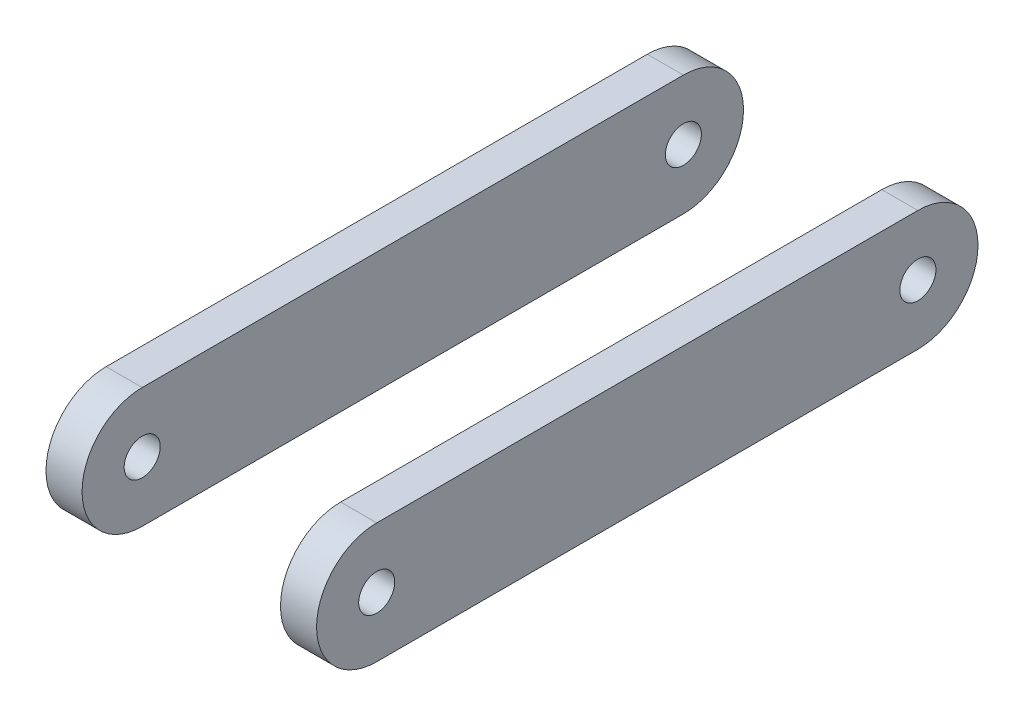
ISO-10303-21;
HEADER;
FILE_DESCRIPTION(('STEP AP214'),'2;1');
FILE_NAME('part.step','',(''),(''),'','','');
FILE_SCHEMA(('AUTOMOTIVE_DESIGN { 1 0 10303 214 1 1 1 1 }'));
ENDSEC;
DATA;
#1=APPLICATION_CONTEXT('core data for automotive mechanical design processes');
#2=APPLICATION_PROTOCOL_DEFINITION('international standard','automotive_design',2000,#1);
#3=PRODUCT_CONTEXT('',#1,'mechanical');
#4=PRODUCT('Part','Part','',(#3));
#5=PRODUCT_RELATED_PRODUCT_CATEGORY('part','',(#4));
#6=PRODUCT_DEFINITION_FORMATION('','',#4);
#7=PRODUCT_DEFINITION_CONTEXT('part definition',#1,'design');
#8=PRODUCT_DEFINITION('design','',#6,#7);
#9=PRODUCT_DEFINITION_SHAPE('','',#8);
#10=(LENGTH_UNIT() NAMED_UNIT(*) SI_UNIT(.MILLI.,.METRE.));
#11=(NAMED_UNIT(*) PLANE_ANGLE_UNIT() SI_UNIT($,.RADIAN.));
#12=(NAMED_UNIT(*) SI_UNIT($,.STERADIAN.) SOLID_ANGLE_UNIT());
#13=UNCERTAINTY_MEASURE_WITH_UNIT(LENGTH_MEASURE(1.E-05),#10,'distance_accuracy_value','');
#14=(GEOMETRIC_REPRESENTATION_CONTEXT(3) GLOBAL_UNCERTAINTY_ASSIGNED_CONTEXT((#13)) GLOBAL_UNIT_ASSIGNED_CONTEXT((#10,
#11,#12)) REPRESENTATION_CONTEXT('',''));
#15=CARTESIAN_POINT('',(0.,0.,0.));
#16=DIRECTION('',(0.,0.,1.));
#17=DIRECTION('',(1.,0.,0.));
#18=AXIS2_PLACEMENT_3D('',#15,#16,#17);
#19=CARTESIAN_POINT('',(-22.5,0.,0.));
#20=DIRECTION('',(1.,0.,0.));
#21=DIRECTION('',(0.,0.,1.));
#22=AXIS2_PLACEMENT_3D('',#19,#20,#21);
#23=CYLINDRICAL_SURFACE('',#22,10.);
#24=CARTESIAN_POINT('',(-16.5,0.,0.));
#25=DIRECTION('',(1.,0.,0.));
#26=DIRECTION('',(0.,0.,-1.));
#27=AXIS2_PLACEMENT_3D('',#24,#25,#26);
#28=CIRCLE('',#27,10.);
#29=CARTESIAN_POINT('',(-16.5,10.,0.));
#30=VERTEX_POINT('',#29);
#31=CARTESIAN_POINT('',(-16.5,-10.,0.));
#32=VERTEX_POINT('',#31);
#33=EDGE_CURVE('E113',#30,#32,#28,.T.);
#34=ORIENTED_EDGE('',*,*,#33,.F.);
#35=DIRECTION('',(1.,0.,0.));
#36=VECTOR('',#35,1.);
#37=CARTESIAN_POINT('',(-22.5,10.,0.));
#38=LINE('',#37,#36);
#39=CARTESIAN_POINT('',(-22.5,10.,0.));
#40=VERTEX_POINT('',#39);
#41=EDGE_CURVE('E112',#40,#30,#38,.T.);
#42=ORIENTED_EDGE('',*,*,#41,.F.);
#43=CARTESIAN_POINT('',(-22.5,0.,0.));
#44=DIRECTION('',(1.,0.,0.));
#45=DIRECTION('',(0.,0.,-1.));
#46=AXIS2_PLACEMENT_3D('',#43,#44,#45);
#47=CIRCLE('',#46,10.);
#48=CARTESIAN_POINT('',(-22.5,-10.,0.));
#49=VERTEX_POINT('',#48);
#50=EDGE_CURVE('E106',#40,#49,#47,.T.);
#51=ORIENTED_EDGE('',*,*,#50,.T.);
#52=DIRECTION('',(1.,0.,0.));
#53=VECTOR('',#52,1.);
#54=CARTESIAN_POINT('',(-22.5,-10.,0.));
#55=LINE('',#54,#53);
#56=EDGE_CURVE('E12',#49,#32,#55,.T.);
#57=ORIENTED_EDGE('',*,*,#56,.T.);
#58=EDGE_LOOP('',(#34,#42,#51,#57));
#59=FACE_BOUND('',#58,.T.);
#60=ADVANCED_FACE('F49',(#59),#23,.T.);
#61=CARTESIAN_POINT('',(-22.5,-10.,0.));
#62=DIRECTION('',(0.,1.,0.));
#63=DIRECTION('',(0.,0.,1.));
#64=AXIS2_PLACEMENT_3D('',#61,#62,#63);
#65=PLANE('',#64);
#66=DIRECTION('',(0.,0.,-1.));
#67=VECTOR('',#66,1.);
#68=CARTESIAN_POINT('',(-16.5,-10.,0.));
#69=LINE('',#68,#67);
#70=CARTESIAN_POINT('',(-16.5,-10.,-90.));
#71=VERTEX_POINT('',#70);
#72=EDGE_CURVE('E115',#32,#71,#69,.T.);
#73=ORIENTED_EDGE('',*,*,#72,.F.);
#74=ORIENTED_EDGE('',*,*,#56,.F.);
#75=DIRECTION('',(0.,0.,-1.));
#76=VECTOR('',#75,1.);
#77=CARTESIAN_POINT('',(-22.5,-10.,0.));
#78=LINE('',#77,#76);
#79=CARTESIAN_POINT('',(-22.5,-10.,-90.));
#80=VERTEX_POINT('',#79);
#81=EDGE_CURVE('E90',#49,#80,#78,.T.);
#82=ORIENTED_EDGE('',*,*,#81,.T.);
#83=DIRECTION('',(1.,0.,0.));
#84=VECTOR('',#83,1.);
#85=CARTESIAN_POINT('',(-22.5,-10.,-90.));
#86=LINE('',#85,#84);
#87=EDGE_CURVE('E57',#80,#71,#86,.T.);
#88=ORIENTED_EDGE('',*,*,#87,.T.);
#89=EDGE_LOOP('',(#73,#74,#82,#88));
#90=FACE_BOUND('',#89,.T.);
#91=ADVANCED_FACE('F104',(#90),#65,.F.);
#92=CARTESIAN_POINT('',(-22.5,0.,-90.));
#93=DIRECTION('',(1.,0.,0.));
#94=DIRECTION('',(0.,0.,1.));
#95=AXIS2_PLACEMENT_3D('',#92,#93,#94);
#96=CYLINDRICAL_SURFACE('',#95,10.);
#97=CARTESIAN_POINT('',(-16.5,0.,-90.));
#98=DIRECTION('',(1.,0.,0.));
#99=DIRECTION('',(0.,0.,-1.));
#100=AXIS2_PLACEMENT_3D('',#97,#98,#99);
#101=CIRCLE('',#100,10.);
#102=CARTESIAN_POINT('',(-16.5,10.,-90.));
#103=VERTEX_POINT('',#102);
#104=EDGE_CURVE('E100',#71,#103,#101,.T.);
#105=ORIENTED_EDGE('',*,*,#104,.F.);
#106=ORIENTED_EDGE('',*,*,#87,.F.);
#107=CARTESIAN_POINT('',(-22.5,0.,-90.));
#108=DIRECTION('',(1.,0.,0.));
#109=DIRECTION('',(0.,0.,-1.));
#110=AXIS2_PLACEMENT_3D('',#107,#108,#109);
#111=CIRCLE('',#110,10.);
#112=CARTESIAN_POINT('',(-22.5,10.,-90.));
#113=VERTEX_POINT('',#112);
#114=EDGE_CURVE('E93',#80,#113,#111,.T.);
#115=ORIENTED_EDGE('',*,*,#114,.T.);
#116=DIRECTION('',(1.,0.,0.));
#117=VECTOR('',#116,1.);
#118=CARTESIAN_POINT('',(-22.5,10.,-90.));
#119=LINE('',#118,#117);
#120=EDGE_CURVE('E103',#113,#103,#119,.T.);
#121=ORIENTED_EDGE('',*,*,#120,.T.);
#122=EDGE_LOOP('',(#105,#106,#115,#121));
#123=FACE_BOUND('',#122,.T.);
#124=ADVANCED_FACE('F99',(#123),#96,.T.);
#125=CARTESIAN_POINT('',(-22.5,10.,0.));
#126=DIRECTION('',(0.,1.,0.));
#127=DIRECTION('',(0.,0.,1.));
#128=AXIS2_PLACEMENT_3D('',#125,#126,#127);
#129=PLANE('',#128);
#130=DIRECTION('',(0.,0.,-1.));
#131=VECTOR('',#130,1.);
#132=CARTESIAN_POINT('',(-16.5,10.,0.));
#133=LINE('',#132,#131);
#134=EDGE_CURVE('E79',#30,#103,#133,.T.);
#135=ORIENTED_EDGE('',*,*,#134,.T.);
#136=ORIENTED_EDGE('',*,*,#120,.F.);
#137=DIRECTION('',(0.,0.,-1.));
#138=VECTOR('',#137,1.);
#139=CARTESIAN_POINT('',(-22.5,10.,0.));
#140=LINE('',#139,#138);
#141=EDGE_CURVE('E65',#40,#113,#140,.T.);
#142=ORIENTED_EDGE('',*,*,#141,.F.);
#143=ORIENTED_EDGE('',*,*,#41,.T.);
#144=EDGE_LOOP('',(#135,#136,#142,#143));
#145=FACE_BOUND('',#144,.T.);
#146=ADVANCED_FACE('F125',(#145),#129,.T.);
#147=CARTESIAN_POINT('',(-22.5,0.,0.));
#148=DIRECTION('',(-1.,0.,0.));
#149=DIRECTION('',(0.,0.,-1.));
#150=AXIS2_PLACEMENT_3D('',#147,#148,#149);
#151=PLANE('',#150);
#152=CARTESIAN_POINT('',(-22.5,0.,0.));
#153=DIRECTION('',(1.,0.,0.));
#154=DIRECTION('',(0.,0.,-1.));
#155=AXIS2_PLACEMENT_3D('',#152,#153,#154);
#156=CIRCLE('',#155,3.00000000000001);
#157=CARTESIAN_POINT('',(-22.5,0.,-3.00000000000001));
#158=VERTEX_POINT('',#157);
#159=EDGE_CURVE('E116',#158,#158,#156,.T.);
#160=ORIENTED_EDGE('',*,*,#159,.T.);
#161=EDGE_LOOP('',(#160));
#162=FACE_BOUND('',#161,.T.);
#163=CARTESIAN_POINT('',(-22.5,0.,-90.));
#164=DIRECTION('',(1.,0.,0.));
#165=DIRECTION('',(0.,0.,-1.));
#166=AXIS2_PLACEMENT_3D('',#163,#164,#165);
#167=CIRCLE('',#166,2.99999999999953);
#168=CARTESIAN_POINT('',(-22.5,0.,-92.9999999999995));
#169=VERTEX_POINT('',#168);
#170=EDGE_CURVE('E196',#169,#169,#167,.T.);
#171=ORIENTED_EDGE('',*,*,#170,.T.);
#172=EDGE_LOOP('',(#171));
#173=FACE_BOUND('',#172,.T.);
#174=ORIENTED_EDGE('',*,*,#50,.F.);
#175=ORIENTED_EDGE('',*,*,#141,.T.);
#176=ORIENTED_EDGE('',*,*,#114,.F.);
#177=ORIENTED_EDGE('',*,*,#81,.F.);
#178=EDGE_LOOP('',(#174,#175,#176,#177));
#179=FACE_BOUND('',#178,.T.);
#180=ADVANCED_FACE('F95',(#162,#173,#179),#151,.T.);
#181=CARTESIAN_POINT('',(-16.5,0.,0.));
#182=DIRECTION('',(-1.,0.,0.));
#183=DIRECTION('',(0.,0.,-1.));
#184=AXIS2_PLACEMENT_3D('',#181,#182,#183);
#185=PLANE('',#184);
#186=CARTESIAN_POINT('',(-16.5,0.,0.));
#187=DIRECTION('',(1.,0.,0.));
#188=DIRECTION('',(0.,0.,-1.));
#189=AXIS2_PLACEMENT_3D('',#186,#187,#188);
#190=CIRCLE('',#189,3.00000000000001);
#191=CARTESIAN_POINT('',(-16.5,0.,-3.00000000000001));
#192=VERTEX_POINT('',#191);
#193=EDGE_CURVE('E195',#192,#192,#190,.T.);
#194=ORIENTED_EDGE('',*,*,#193,.F.);
#195=EDGE_LOOP('',(#194));
#196=FACE_BOUND('',#195,.T.);
#197=CARTESIAN_POINT('',(-16.5,0.,-90.));
#198=DIRECTION('',(1.,0.,0.));
#199=DIRECTION('',(0.,0.,-1.));
#200=AXIS2_PLACEMENT_3D('',#197,#198,#199);
#201=CIRCLE('',#200,2.99999999999953);
#202=CARTESIAN_POINT('',(-16.5,0.,-92.9999999999995));
#203=VERTEX_POINT('',#202);
#204=EDGE_CURVE('E197',#203,#203,#201,.T.);
#205=ORIENTED_EDGE('',*,*,#204,.F.);
#206=EDGE_LOOP('',(#205));
#207=FACE_BOUND('',#206,.T.);
#208=ORIENTED_EDGE('',*,*,#33,.T.);
#209=ORIENTED_EDGE('',*,*,#72,.T.);
#210=ORIENTED_EDGE('',*,*,#104,.T.);
#211=ORIENTED_EDGE('',*,*,#134,.F.);
#212=EDGE_LOOP('',(#208,#209,#210,#211));
#213=FACE_BOUND('',#212,.T.);
#214=ADVANCED_FACE('F121',(#196,#207,#213),#185,.F.);
#215=CARTESIAN_POINT('',(-16.5,0.,-90.));
#216=DIRECTION('',(-1.,0.,0.));
#217=DIRECTION('',(0.,0.,-1.));
#218=AXIS2_PLACEMENT_3D('',#215,#216,#217);
#219=CYLINDRICAL_SURFACE('',#218,2.99999999999953);
#220=ORIENTED_EDGE('',*,*,#170,.F.);
#221=EDGE_LOOP('',(#220));
#222=FACE_BOUND('',#221,.T.);
#223=ORIENTED_EDGE('',*,*,#204,.T.);
#224=EDGE_LOOP('',(#223));
#225=FACE_BOUND('',#224,.T.);
#226=ADVANCED_FACE('F167',(#222,#225),#219,.F.);
#227=CARTESIAN_POINT('',(-16.5,0.,0.));
#228=DIRECTION('',(-1.,0.,0.));
#229=DIRECTION('',(0.,0.,-1.));
#230=AXIS2_PLACEMENT_3D('',#227,#228,#229);
#231=CYLINDRICAL_SURFACE('',#230,3.00000000000001);
#232=ORIENTED_EDGE('',*,*,#159,.F.);
#233=EDGE_LOOP('',(#232));
#234=FACE_BOUND('',#233,.T.);
#235=ORIENTED_EDGE('',*,*,#193,.T.);
#236=EDGE_LOOP('',(#235));
#237=FACE_BOUND('',#236,.T.);
#238=ADVANCED_FACE('F176',(#234,#237),#231,.F.);
#239=CLOSED_SHELL('',(#60,#91,#124,#146,#180,#214,#226,#238));
#240=MANIFOLD_SOLID_BREP('B2',#239);
#241=CARTESIAN_POINT('',(22.5,0.,0.));
#242=DIRECTION('',(-1.,0.,0.));
#243=DIRECTION('',(0.,0.,1.));
#244=AXIS2_PLACEMENT_3D('',#241,#242,#243);
#245=CYLINDRICAL_SURFACE('',#244,10.);
#246=CARTESIAN_POINT('',(16.5,0.,0.));
#247=DIRECTION('',(1.,0.,0.));
#248=DIRECTION('',(0.,0.,-1.));
#249=AXIS2_PLACEMENT_3D('',#246,#247,#248);
#250=CIRCLE('',#249,10.);
#251=CARTESIAN_POINT('',(16.5,10.,0.));
#252=VERTEX_POINT('',#251);
#253=CARTESIAN_POINT('',(16.5,-10.,0.));
#254=VERTEX_POINT('',#253);
#255=EDGE_CURVE('E278',#252,#254,#250,.T.);
#256=ORIENTED_EDGE('',*,*,#255,.T.);
#257=DIRECTION('',(-1.,0.,0.));
#258=VECTOR('',#257,1.);
#259=CARTESIAN_POINT('',(22.5,-10.,0.));
#260=LINE('',#259,#258);
#261=CARTESIAN_POINT('',(22.5,-10.,0.));
#262=VERTEX_POINT('',#261);
#263=EDGE_CURVE('E47',#262,#254,#260,.T.);
#264=ORIENTED_EDGE('',*,*,#263,.F.);
#265=CARTESIAN_POINT('',(22.5,0.,0.));
#266=DIRECTION('',(1.,0.,0.));
#267=DIRECTION('',(0.,0.,-1.));
#268=AXIS2_PLACEMENT_3D('',#265,#266,#267);
#269=CIRCLE('',#268,10.);
#270=CARTESIAN_POINT('',(22.5,10.,0.));
#271=VERTEX_POINT('',#270);
#272=EDGE_CURVE('E264',#271,#262,#269,.T.);
#273=ORIENTED_EDGE('',*,*,#272,.F.);
#274=DIRECTION('',(-1.,0.,0.));
#275=VECTOR('',#274,1.);
#276=CARTESIAN_POINT('',(22.5,10.,0.));
#277=LINE('',#276,#275);
#278=EDGE_CURVE('E231',#271,#252,#277,.T.);
#279=ORIENTED_EDGE('',*,*,#278,.T.);
#280=EDGE_LOOP('',(#256,#264,#273,#279));
#281=FACE_BOUND('',#280,.T.);
#282=ADVANCED_FACE('F215',(#281),#245,.T.);
#283=CARTESIAN_POINT('',(22.5,-10.,0.));
#284=DIRECTION('',(0.,1.,0.));
#285=DIRECTION('',(0.,0.,1.));
#286=AXIS2_PLACEMENT_3D('',#283,#284,#285);
#287=PLANE('',#286);
#288=DIRECTION('',(0.,0.,-1.));
#289=VECTOR('',#288,1.);
#290=CARTESIAN_POINT('',(16.5,-10.,0.));
#291=LINE('',#290,#289);
#292=CARTESIAN_POINT('',(16.5,-10.,-90.));
#293=VERTEX_POINT('',#292);
#294=EDGE_CURVE('E269',#254,#293,#291,.T.);
#295=ORIENTED_EDGE('',*,*,#294,.T.);
#296=DIRECTION('',(-1.,0.,0.));
#297=VECTOR('',#296,1.);
#298=CARTESIAN_POINT('',(22.5,-10.,-90.));
#299=LINE('',#298,#297);
#300=CARTESIAN_POINT('',(22.5,-10.,-90.));
#301=VERTEX_POINT('',#300);
#302=EDGE_CURVE('E223',#301,#293,#299,.T.);
#303=ORIENTED_EDGE('',*,*,#302,.F.);
#304=DIRECTION('',(0.,0.,-1.));
#305=VECTOR('',#304,1.);
#306=CARTESIAN_POINT('',(22.5,-10.,0.));
#307=LINE('',#306,#305);
#308=EDGE_CURVE('E257',#262,#301,#307,.T.);
#309=ORIENTED_EDGE('',*,*,#308,.F.);
#310=ORIENTED_EDGE('',*,*,#263,.T.);
#311=EDGE_LOOP('',(#295,#303,#309,#310));
#312=FACE_BOUND('',#311,.T.);
#313=ADVANCED_FACE('F268',(#312),#287,.F.);
#314=CARTESIAN_POINT('',(22.5,0.,-90.));
#315=DIRECTION('',(-1.,0.,0.));
#316=DIRECTION('',(0.,0.,1.));
#317=AXIS2_PLACEMENT_3D('',#314,#315,#316);
#318=CYLINDRICAL_SURFACE('',#317,10.);
#319=CARTESIAN_POINT('',(16.5,0.,-90.));
#320=DIRECTION('',(1.,0.,0.));
#321=DIRECTION('',(0.,0.,-1.));
#322=AXIS2_PLACEMENT_3D('',#319,#320,#321);
#323=CIRCLE('',#322,10.);
#324=CARTESIAN_POINT('',(16.5,10.,-90.));
#325=VERTEX_POINT('',#324);
#326=EDGE_CURVE('E282',#293,#325,#323,.T.);
#327=ORIENTED_EDGE('',*,*,#326,.T.);
#328=DIRECTION('',(-1.,0.,0.));
#329=VECTOR('',#328,1.);
#330=CARTESIAN_POINT('',(22.5,10.,-90.));
#331=LINE('',#330,#329);
#332=CARTESIAN_POINT('',(22.5,10.,-90.));
#333=VERTEX_POINT('',#332);
#334=EDGE_CURVE('E246',#333,#325,#331,.T.);
#335=ORIENTED_EDGE('',*,*,#334,.F.);
#336=CARTESIAN_POINT('',(22.5,0.,-90.));
#337=DIRECTION('',(1.,0.,0.));
#338=DIRECTION('',(0.,0.,-1.));
#339=AXIS2_PLACEMENT_3D('',#336,#337,#338);
#340=CIRCLE('',#339,10.);
#341=EDGE_CURVE('E263',#301,#333,#340,.T.);
#342=ORIENTED_EDGE('',*,*,#341,.F.);
#343=ORIENTED_EDGE('',*,*,#302,.T.);
#344=EDGE_LOOP('',(#327,#335,#342,#343));
#345=FACE_BOUND('',#344,.T.);
#346=ADVANCED_FACE('F272',(#345),#318,.T.);
#347=CARTESIAN_POINT('',(22.5,10.,0.));
#348=DIRECTION('',(0.,1.,0.));
#349=DIRECTION('',(0.,0.,1.));
#350=AXIS2_PLACEMENT_3D('',#347,#348,#349);
#351=PLANE('',#350);
#352=DIRECTION('',(0.,0.,-1.));
#353=VECTOR('',#352,1.);
#354=CARTESIAN_POINT('',(16.5,10.,0.));
#355=LINE('',#354,#353);
#356=EDGE_CURVE('E284',#252,#325,#355,.T.);
#357=ORIENTED_EDGE('',*,*,#356,.F.);
#358=ORIENTED_EDGE('',*,*,#278,.F.);
#359=DIRECTION('',(0.,0.,-1.));
#360=VECTOR('',#359,1.);
#361=CARTESIAN_POINT('',(22.5,10.,0.));
#362=LINE('',#361,#360);
#363=EDGE_CURVE('E273',#271,#333,#362,.T.);
#364=ORIENTED_EDGE('',*,*,#363,.T.);
#365=ORIENTED_EDGE('',*,*,#334,.T.);
#366=EDGE_LOOP('',(#357,#358,#364,#365));
#367=FACE_BOUND('',#366,.T.);
#368=ADVANCED_FACE('F319',(#367),#351,.T.);
#369=CARTESIAN_POINT('',(22.5,0.,0.));
#370=DIRECTION('',(1.,0.,0.));
#371=DIRECTION('',(0.,0.,-1.));
#372=AXIS2_PLACEMENT_3D('',#369,#370,#371);
#373=PLANE('',#372);
#374=CARTESIAN_POINT('',(22.5,0.,0.));
#375=DIRECTION('',(1.,0.,0.));
#376=DIRECTION('',(0.,0.,-1.));
#377=AXIS2_PLACEMENT_3D('',#374,#375,#376);
#378=CIRCLE('',#377,3.00000000000001);
#379=CARTESIAN_POINT('',(22.5,0.,-3.00000000000001));
#380=VERTEX_POINT('',#379);
#381=EDGE_CURVE('E280',#380,#380,#378,.T.);
#382=ORIENTED_EDGE('',*,*,#381,.F.);
#383=EDGE_LOOP('',(#382));
#384=FACE_BOUND('',#383,.T.);
#385=CARTESIAN_POINT('',(22.5,0.,-90.));
#386=DIRECTION('',(1.,0.,0.));
#387=DIRECTION('',(0.,0.,-1.));
#388=AXIS2_PLACEMENT_3D('',#385,#386,#387);
#389=CIRCLE('',#388,2.99999999999953);
#390=CARTESIAN_POINT('',(22.5,0.,-92.9999999999995));
#391=VERTEX_POINT('',#390);
#392=EDGE_CURVE('E292',#391,#391,#389,.T.);
#393=ORIENTED_EDGE('',*,*,#392,.F.);
#394=EDGE_LOOP('',(#393));
#395=FACE_BOUND('',#394,.T.);
#396=ORIENTED_EDGE('',*,*,#272,.T.);
#397=ORIENTED_EDGE('',*,*,#308,.T.);
#398=ORIENTED_EDGE('',*,*,#341,.T.);
#399=ORIENTED_EDGE('',*,*,#363,.F.);
#400=EDGE_LOOP('',(#396,#397,#398,#399));
#401=FACE_BOUND('',#400,.T.);
#402=ADVANCED_FACE('F260',(#384,#395,#401),#373,.T.);
#403=CARTESIAN_POINT('',(16.5,0.,0.));
#404=DIRECTION('',(1.,0.,0.));
#405=DIRECTION('',(0.,0.,-1.));
#406=AXIS2_PLACEMENT_3D('',#403,#404,#405);
#407=PLANE('',#406);
#408=CARTESIAN_POINT('',(16.5,0.,0.));
#409=DIRECTION('',(1.,0.,0.));
#410=DIRECTION('',(0.,0.,-1.));
#411=AXIS2_PLACEMENT_3D('',#408,#409,#410);
#412=CIRCLE('',#411,3.00000000000001);
#413=CARTESIAN_POINT('',(16.5,0.,-3.00000000000001));
#414=VERTEX_POINT('',#413);
#415=EDGE_CURVE('E295',#414,#414,#412,.T.);
#416=ORIENTED_EDGE('',*,*,#415,.T.);
#417=EDGE_LOOP('',(#416));
#418=FACE_BOUND('',#417,.T.);
#419=CARTESIAN_POINT('',(16.5,0.,-90.));
#420=DIRECTION('',(1.,0.,0.));
#421=DIRECTION('',(0.,0.,-1.));
#422=AXIS2_PLACEMENT_3D('',#419,#420,#421);
#423=CIRCLE('',#422,2.99999999999953);
#424=CARTESIAN_POINT('',(16.5,0.,-92.9999999999995));
#425=VERTEX_POINT('',#424);
#426=EDGE_CURVE('E296',#425,#425,#423,.T.);
#427=ORIENTED_EDGE('',*,*,#426,.T.);
#428=EDGE_LOOP('',(#427));
#429=FACE_BOUND('',#428,.T.);
#430=ORIENTED_EDGE('',*,*,#255,.F.);
#431=ORIENTED_EDGE('',*,*,#356,.T.);
#432=ORIENTED_EDGE('',*,*,#326,.F.);
#433=ORIENTED_EDGE('',*,*,#294,.F.);
#434=EDGE_LOOP('',(#430,#431,#432,#433));
#435=FACE_BOUND('',#434,.T.);
#436=ADVANCED_FACE('F302',(#418,#429,#435),#407,.F.);
#437=CARTESIAN_POINT('',(16.5,0.,-90.));
#438=DIRECTION('',(1.,0.,0.));
#439=DIRECTION('',(0.,0.,-1.));
#440=AXIS2_PLACEMENT_3D('',#437,#438,#439);
#441=CYLINDRICAL_SURFACE('',#440,2.99999999999953);
#442=ORIENTED_EDGE('',*,*,#392,.T.);
#443=EDGE_LOOP('',(#442));
#444=FACE_BOUND('',#443,.T.);
#445=ORIENTED_EDGE('',*,*,#426,.F.);
#446=EDGE_LOOP('',(#445));
#447=FACE_BOUND('',#446,.T.);
#448=ADVANCED_FACE('F307',(#444,#447),#441,.F.);
#449=CARTESIAN_POINT('',(16.5,0.,0.));
#450=DIRECTION('',(1.,0.,0.));
#451=DIRECTION('',(0.,0.,-1.));
#452=AXIS2_PLACEMENT_3D('',#449,#450,#451);
#453=CYLINDRICAL_SURFACE('',#452,3.00000000000001);
#454=ORIENTED_EDGE('',*,*,#381,.T.);
#455=EDGE_LOOP('',(#454));
#456=FACE_BOUND('',#455,.T.);
#457=ORIENTED_EDGE('',*,*,#415,.F.);
#458=EDGE_LOOP('',(#457));
#459=FACE_BOUND('',#458,.T.);
#460=ADVANCED_FACE('F305',(#456,#459),#453,.F.);
#461=CLOSED_SHELL('',(#282,#313,#346,#368,#402,#436,#448,#460));
#462=MANIFOLD_SOLID_BREP('B6',#461);
#463=ADVANCED_BREP_SHAPE_REPRESENTATION('',(#18,#240,#462),#14);
#464=SHAPE_DEFINITION_REPRESENTATION(#9,#463);
ENDSEC;
END-ISO-10303-21;
